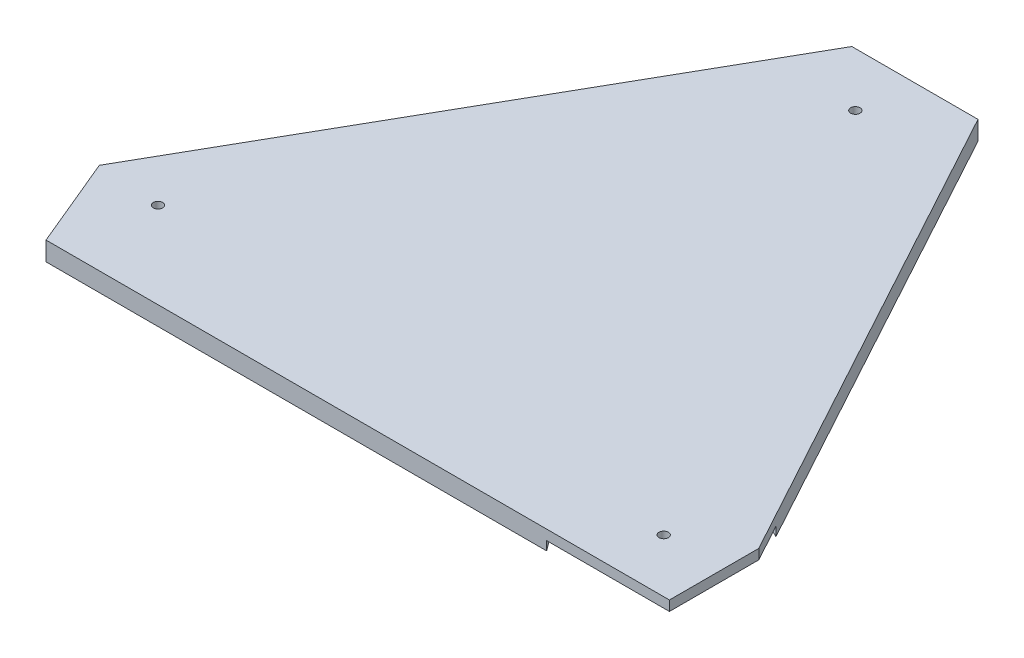
ISO-10303-21;
HEADER;
FILE_DESCRIPTION(('STEP AP214'),'2;1');
FILE_NAME('part.step','',(''),(''),'','','');
FILE_SCHEMA(('AUTOMOTIVE_DESIGN { 1 0 10303 214 1 1 1 1 }'));
ENDSEC;
DATA;
#1=APPLICATION_CONTEXT('core data for automotive mechanical design processes');
#2=APPLICATION_PROTOCOL_DEFINITION('international standard','automotive_design',2000,#1);
#3=PRODUCT_CONTEXT('',#1,'mechanical');
#4=PRODUCT('Part','Part','',(#3));
#5=PRODUCT_RELATED_PRODUCT_CATEGORY('part','',(#4));
#6=PRODUCT_DEFINITION_FORMATION('','',#4);
#7=PRODUCT_DEFINITION_CONTEXT('part definition',#1,'design');
#8=PRODUCT_DEFINITION('design','',#6,#7);
#9=PRODUCT_DEFINITION_SHAPE('','',#8);
#10=(LENGTH_UNIT() NAMED_UNIT(*) SI_UNIT(.MILLI.,.METRE.));
#11=(NAMED_UNIT(*) PLANE_ANGLE_UNIT() SI_UNIT($,.RADIAN.));
#12=(NAMED_UNIT(*) SI_UNIT($,.STERADIAN.) SOLID_ANGLE_UNIT());
#13=UNCERTAINTY_MEASURE_WITH_UNIT(LENGTH_MEASURE(1.E-05),#10,'distance_accuracy_value','');
#14=(GEOMETRIC_REPRESENTATION_CONTEXT(3) GLOBAL_UNCERTAINTY_ASSIGNED_CONTEXT((#13)) GLOBAL_UNIT_ASSIGNED_CONTEXT((#10,
#11,#12)) REPRESENTATION_CONTEXT('',''));
#15=CARTESIAN_POINT('',(0.,0.,0.));
#16=DIRECTION('',(0.,0.,1.));
#17=DIRECTION('',(1.,0.,0.));
#18=AXIS2_PLACEMENT_3D('',#15,#16,#17);
#19=CARTESIAN_POINT('',(0.,15.875,-75.0824));
#20=DIRECTION('',(-1.,0.,0.));
#21=DIRECTION('',(0.,0.,1.));
#22=AXIS2_PLACEMENT_3D('',#19,#20,#21);
#23=PLANE('',#22);
#24=DIRECTION('',(0.,0.,1.));
#25=VECTOR('',#24,1.);
#26=CARTESIAN_POINT('',(0.,7.493,-75.0824));
#27=LINE('',#26,#25);
#28=CARTESIAN_POINT('',(0.,7.493,-75.0824));
#29=VERTEX_POINT('',#28);
#30=CARTESIAN_POINT('',(0.,7.493,0.));
#31=VERTEX_POINT('',#30);
#32=EDGE_CURVE('E216',#29,#31,#27,.T.);
#33=ORIENTED_EDGE('',*,*,#32,.F.);
#34=DIRECTION('',(0.,-1.,0.));
#35=VECTOR('',#34,1.);
#36=CARTESIAN_POINT('',(0.,15.875,-75.0824));
#37=LINE('',#36,#35);
#38=CARTESIAN_POINT('',(0.,15.875,-75.0824));
#39=VERTEX_POINT('',#38);
#40=EDGE_CURVE('E11',#39,#29,#37,.T.);
#41=ORIENTED_EDGE('',*,*,#40,.F.);
#42=DIRECTION('',(0.,0.,-1.));
#43=VECTOR('',#42,1.);
#44=CARTESIAN_POINT('',(0.,15.875,-75.0824));
#45=LINE('',#44,#43);
#46=CARTESIAN_POINT('',(0.,15.875,0.));
#47=VERTEX_POINT('',#46);
#48=EDGE_CURVE('E173',#47,#39,#45,.T.);
#49=ORIENTED_EDGE('',*,*,#48,.F.);
#50=DIRECTION('',(0.,-1.,0.));
#51=VECTOR('',#50,1.);
#52=CARTESIAN_POINT('',(0.,15.875,0.));
#53=LINE('',#52,#51);
#54=EDGE_CURVE('E174',#47,#31,#53,.T.);
#55=ORIENTED_EDGE('',*,*,#54,.T.);
#56=EDGE_LOOP('',(#33,#41,#49,#55));
#57=FACE_BOUND('',#56,.T.);
#58=ADVANCED_FACE('F38',(#57),#23,.F.);
#59=CARTESIAN_POINT('',(-49.7332,0.,-44.9325999999999));
#60=DIRECTION('',(0.,1.,0.));
#61=DIRECTION('',(0.,0.,1.));
#62=AXIS2_PLACEMENT_3D('',#59,#60,#61);
#63=CYLINDRICAL_SURFACE('',#62,3.96874999999998);
#64=CARTESIAN_POINT('',(-49.7332,15.875,-44.9325999999999));
#65=DIRECTION('',(0.,1.,0.));
#66=DIRECTION('',(0.,0.,1.));
#67=AXIS2_PLACEMENT_3D('',#64,#65,#66);
#68=CIRCLE('',#67,3.96874999999998);
#69=CARTESIAN_POINT('',(-49.7332,15.875,-40.96385));
#70=VERTEX_POINT('',#69);
#71=EDGE_CURVE('E237',#70,#70,#68,.T.);
#72=ORIENTED_EDGE('',*,*,#71,.T.);
#73=EDGE_LOOP('',(#72));
#74=FACE_BOUND('',#73,.T.);
#75=CARTESIAN_POINT('',(-49.7332,7.493,-44.9325999999999));
#76=DIRECTION('',(0.,-1.,0.));
#77=DIRECTION('',(0.,0.,-1.));
#78=AXIS2_PLACEMENT_3D('',#75,#76,#77);
#79=CIRCLE('',#78,3.96874999999998);
#80=CARTESIAN_POINT('',(-49.7332,7.493,-48.9013499999999));
#81=VERTEX_POINT('',#80);
#82=EDGE_CURVE('E41',#81,#81,#79,.F.);
#83=ORIENTED_EDGE('',*,*,#82,.F.);
#84=EDGE_LOOP('',(#83));
#85=FACE_BOUND('',#84,.T.);
#86=ADVANCED_FACE('F324',(#74,#85),#63,.F.);
#87=CARTESIAN_POINT('',(-502.204578123616,0.,-72.4407999999999));
#88=DIRECTION('',(0.,1.,0.));
#89=DIRECTION('',(0.,0.,1.));
#90=AXIS2_PLACEMENT_3D('',#87,#88,#89);
#91=CYLINDRICAL_SURFACE('',#90,3.96875000000005);
#92=CARTESIAN_POINT('',(-502.204578123616,15.875,-72.4407999999999));
#93=DIRECTION('',(0.,1.,0.));
#94=DIRECTION('',(0.,0.,1.));
#95=AXIS2_PLACEMENT_3D('',#92,#93,#94);
#96=CIRCLE('',#95,3.96875000000005);
#97=CARTESIAN_POINT('',(-502.204578123616,15.875,-68.4720499999999));
#98=VERTEX_POINT('',#97);
#99=EDGE_CURVE('E241',#98,#98,#96,.T.);
#100=ORIENTED_EDGE('',*,*,#99,.T.);
#101=EDGE_LOOP('',(#100));
#102=FACE_BOUND('',#101,.T.);
#103=CARTESIAN_POINT('',(-502.204578123616,7.493,-72.4407999999999));
#104=DIRECTION('',(0.,-1.,0.));
#105=DIRECTION('',(0.,0.,-1.));
#106=AXIS2_PLACEMENT_3D('',#103,#104,#105);
#107=CIRCLE('',#106,3.96875000000005);
#108=CARTESIAN_POINT('',(-502.204578123616,7.493,-76.40955));
#109=VERTEX_POINT('',#108);
#110=EDGE_CURVE('E197',#109,#109,#107,.F.);
#111=ORIENTED_EDGE('',*,*,#110,.F.);
#112=EDGE_LOOP('',(#111));
#113=FACE_BOUND('',#112,.T.);
#114=ADVANCED_FACE('F329',(#102,#113),#91,.F.);
#115=CARTESIAN_POINT('',(-278.106809958904,0.,-434.34));
#116=DIRECTION('',(0.,1.,0.));
#117=DIRECTION('',(0.,0.,1.));
#118=AXIS2_PLACEMENT_3D('',#115,#116,#117);
#119=CYLINDRICAL_SURFACE('',#118,3.96875000000005);
#120=CARTESIAN_POINT('',(-278.106809958904,15.875,-434.34));
#121=DIRECTION('',(0.,1.,0.));
#122=DIRECTION('',(0.,0.,1.));
#123=AXIS2_PLACEMENT_3D('',#120,#121,#122);
#124=CIRCLE('',#123,3.96875000000005);
#125=CARTESIAN_POINT('',(-278.106809958904,15.875,-430.37125));
#126=VERTEX_POINT('',#125);
#127=EDGE_CURVE('E160',#126,#126,#124,.T.);
#128=ORIENTED_EDGE('',*,*,#127,.T.);
#129=EDGE_LOOP('',(#128));
#130=FACE_BOUND('',#129,.T.);
#131=CARTESIAN_POINT('',(-278.106809958904,7.493,-434.34));
#132=DIRECTION('',(0.,-1.,0.));
#133=DIRECTION('',(0.,0.,-1.));
#134=AXIS2_PLACEMENT_3D('',#131,#132,#133);
#135=CIRCLE('',#134,3.96875000000005);
#136=CARTESIAN_POINT('',(-278.106809958904,7.493,-438.30875));
#137=VERTEX_POINT('',#136);
#138=EDGE_CURVE('E193',#137,#137,#135,.F.);
#139=ORIENTED_EDGE('',*,*,#138,.F.);
#140=EDGE_LOOP('',(#139));
#141=FACE_BOUND('',#140,.T.);
#142=ADVANCED_FACE('F335',(#130,#141),#119,.F.);
#143=CARTESIAN_POINT('',(-220.118609958904,15.875,-479.425));
#144=DIRECTION('',(-0.878289655172414,0.,0.478128938276196));
#145=DIRECTION('',(0.478128938276196,0.,0.878289655172414));
#146=AXIS2_PLACEMENT_3D('',#143,#144,#145);
#147=PLANE('',#146);
#148=DIRECTION('',(0.478128938276196,0.,0.878289655172414));
#149=VECTOR('',#148,1.);
#150=CARTESIAN_POINT('',(-220.118609958904,7.493,-479.425));
#151=LINE('',#150,#149);
#152=CARTESIAN_POINT('',(-17.2504188678722,7.493,-106.770221476915));
#153=VERTEX_POINT('',#152);
#154=EDGE_CURVE('E219',#153,#29,#151,.T.);
#155=ORIENTED_EDGE('',*,*,#154,.F.);
#156=DIRECTION('',(0.,-1.,0.));
#157=VECTOR('',#156,1.);
#158=CARTESIAN_POINT('',(-17.2504188678722,7.493,-106.770221476915));
#159=LINE('',#158,#157);
#160=CARTESIAN_POINT('',(-17.2504188678723,0.,-106.770221476915));
#161=VERTEX_POINT('',#160);
#162=EDGE_CURVE('E227',#153,#161,#159,.T.);
#163=ORIENTED_EDGE('',*,*,#162,.T.);
#164=DIRECTION('',(-0.478128938276196,0.,-0.878289655172414));
#165=VECTOR('',#164,1.);
#166=CARTESIAN_POINT('',(-220.118609958904,0.,-479.425));
#167=LINE('',#166,#165);
#168=CARTESIAN_POINT('',(-220.118609958904,0.,-479.425));
#169=VERTEX_POINT('',#168);
#170=EDGE_CURVE('E156',#161,#169,#167,.T.);
#171=ORIENTED_EDGE('',*,*,#170,.T.);
#172=DIRECTION('',(0.,-1.,0.));
#173=VECTOR('',#172,1.);
#174=CARTESIAN_POINT('',(-220.118609958904,15.875,-479.425));
#175=LINE('',#174,#173);
#176=CARTESIAN_POINT('',(-220.118609958904,15.875,-479.425));
#177=VERTEX_POINT('',#176);
#178=EDGE_CURVE('E47',#177,#169,#175,.T.);
#179=ORIENTED_EDGE('',*,*,#178,.F.);
#180=DIRECTION('',(-0.478128938276196,0.,-0.878289655172414));
#181=VECTOR('',#180,1.);
#182=CARTESIAN_POINT('',(-220.118609958904,15.875,-479.425));
#183=LINE('',#182,#181);
#184=EDGE_CURVE('E251',#39,#177,#183,.T.);
#185=ORIENTED_EDGE('',*,*,#184,.F.);
#186=ORIENTED_EDGE('',*,*,#40,.T.);
#187=EDGE_LOOP('',(#155,#163,#171,#179,#185,#186));
#188=FACE_BOUND('',#187,.T.);
#189=ADVANCED_FACE('F278',(#188),#147,.F.);
#190=CARTESIAN_POINT('',(-326.138209958904,15.875,-479.425));
#191=DIRECTION('',(0.,0.,1.));
#192=DIRECTION('',(1.,0.,0.));
#193=AXIS2_PLACEMENT_3D('',#190,#191,#192);
#194=PLANE('',#193);
#195=DIRECTION('',(1.,0.,0.));
#196=VECTOR('',#195,1.);
#197=CARTESIAN_POINT('',(-326.138209958904,7.493,-479.425));
#198=LINE('',#197,#196);
#199=CARTESIAN_POINT('',(-322.823616363208,7.493,-479.425));
#200=VERTEX_POINT('',#199);
#201=CARTESIAN_POINT('',(-233.3900035546,7.493,-479.425));
#202=VERTEX_POINT('',#201);
#203=EDGE_CURVE('E146',#200,#202,#198,.T.);
#204=ORIENTED_EDGE('',*,*,#203,.F.);
#205=DIRECTION('',(0.,-1.,0.));
#206=VECTOR('',#205,1.);
#207=CARTESIAN_POINT('',(-322.823616363208,7.493,-479.425));
#208=LINE('',#207,#206);
#209=CARTESIAN_POINT('',(-322.823616363208,0.,-479.425));
#210=VERTEX_POINT('',#209);
#211=EDGE_CURVE('E131',#200,#210,#208,.T.);
#212=ORIENTED_EDGE('',*,*,#211,.T.);
#213=DIRECTION('',(-1.,0.,0.));
#214=VECTOR('',#213,1.);
#215=CARTESIAN_POINT('',(-326.138209958904,0.,-479.425));
#216=LINE('',#215,#214);
#217=CARTESIAN_POINT('',(-326.138209958904,0.,-479.425));
#218=VERTEX_POINT('',#217);
#219=EDGE_CURVE('E144',#210,#218,#216,.T.);
#220=ORIENTED_EDGE('',*,*,#219,.T.);
#221=DIRECTION('',(0.,-1.,0.));
#222=VECTOR('',#221,1.);
#223=CARTESIAN_POINT('',(-326.138209958904,15.875,-479.425));
#224=LINE('',#223,#222);
#225=CARTESIAN_POINT('',(-326.138209958904,15.875,-479.425));
#226=VERTEX_POINT('',#225);
#227=EDGE_CURVE('E187',#226,#218,#224,.T.);
#228=ORIENTED_EDGE('',*,*,#227,.F.);
#229=DIRECTION('',(-1.,0.,0.));
#230=VECTOR('',#229,1.);
#231=CARTESIAN_POINT('',(-326.138209958904,15.875,-479.425));
#232=LINE('',#231,#230);
#233=EDGE_CURVE('E254',#177,#226,#232,.T.);
#234=ORIENTED_EDGE('',*,*,#233,.F.);
#235=ORIENTED_EDGE('',*,*,#178,.T.);
#236=CARTESIAN_POINT('',(-233.3900035546,0.,-479.425));
#237=VERTEX_POINT('',#236);
#238=EDGE_CURVE('E155',#169,#237,#216,.T.);
#239=ORIENTED_EDGE('',*,*,#238,.T.);
#240=DIRECTION('',(0.,-1.,0.));
#241=VECTOR('',#240,1.);
#242=CARTESIAN_POINT('',(-233.3900035546,7.493,-479.425));
#243=LINE('',#242,#241);
#244=EDGE_CURVE('E55',#237,#202,#243,.F.);
#245=ORIENTED_EDGE('',*,*,#244,.T.);
#246=EDGE_LOOP('',(#204,#212,#220,#228,#234,#235,#239,#245));
#247=FACE_BOUND('',#246,.T.);
#248=ADVANCED_FACE('F142',(#247),#194,.F.);
#249=CARTESIAN_POINT('',(-555.849378123616,15.875,-76.7944227701986));
#250=DIRECTION('',(0.868580686505882,0.,0.495547768665112));
#251=DIRECTION('',(0.495547768665112,0.,-0.868580686505882));
#252=AXIS2_PLACEMENT_3D('',#249,#250,#251);
#253=PLANE('',#252);
#254=DIRECTION('',(-0.495547768665112,0.,0.868580686505882));
#255=VECTOR('',#254,1.);
#256=CARTESIAN_POINT('',(-555.849378123616,0.,-76.7944227701986));
#257=LINE('',#256,#255);
#258=CARTESIAN_POINT('',(-524.387291001228,0.,-131.940188647191));
#259=VERTEX_POINT('',#258);
#260=EDGE_CURVE('E153',#218,#259,#257,.T.);
#261=ORIENTED_EDGE('',*,*,#260,.T.);
#262=DIRECTION('',(0.,-1.,0.));
#263=VECTOR('',#262,1.);
#264=CARTESIAN_POINT('',(-524.387291001228,7.493,-131.940188647191));
#265=LINE('',#264,#263);
#266=CARTESIAN_POINT('',(-524.387291001228,7.493,-131.940188647191));
#267=VERTEX_POINT('',#266);
#268=EDGE_CURVE('E63',#259,#267,#265,.F.);
#269=ORIENTED_EDGE('',*,*,#268,.T.);
#270=DIRECTION('',(0.495547768665112,0.,-0.868580686505882));
#271=VECTOR('',#270,1.);
#272=CARTESIAN_POINT('',(-555.849378123616,7.493,-76.7944227701986));
#273=LINE('',#272,#271);
#274=CARTESIAN_POINT('',(-555.849378123616,7.493,-76.7944227701986));
#275=VERTEX_POINT('',#274);
#276=EDGE_CURVE('E205',#275,#267,#273,.T.);
#277=ORIENTED_EDGE('',*,*,#276,.F.);
#278=DIRECTION('',(0.,-1.,0.));
#279=VECTOR('',#278,1.);
#280=CARTESIAN_POINT('',(-555.849378123616,15.875,-76.7944227701986));
#281=LINE('',#280,#279);
#282=CARTESIAN_POINT('',(-555.849378123616,15.875,-76.7944227701986));
#283=VERTEX_POINT('',#282);
#284=EDGE_CURVE('E183',#283,#275,#281,.T.);
#285=ORIENTED_EDGE('',*,*,#284,.F.);
#286=DIRECTION('',(-0.495547768665112,0.,0.868580686505882));
#287=VECTOR('',#286,1.);
#288=CARTESIAN_POINT('',(-555.849378123616,15.875,-76.7944227701986));
#289=LINE('',#288,#287);
#290=EDGE_CURVE('E257',#226,#283,#289,.T.);
#291=ORIENTED_EDGE('',*,*,#290,.F.);
#292=ORIENTED_EDGE('',*,*,#227,.T.);
#293=EDGE_LOOP('',(#261,#269,#277,#285,#291,#292));
#294=FACE_BOUND('',#293,.T.);
#295=ADVANCED_FACE('F284',(#294),#253,.F.);
#296=CARTESIAN_POINT('',(-523.875,15.875,0.));
#297=DIRECTION('',(0.92317632710463,0.,-0.384376728059342));
#298=DIRECTION('',(-0.384376728059342,0.,-0.92317632710463));
#299=AXIS2_PLACEMENT_3D('',#296,#297,#298);
#300=PLANE('',#299);
#301=DIRECTION('',(-0.384376728059342,0.,-0.92317632710463));
#302=VECTOR('',#301,1.);
#303=CARTESIAN_POINT('',(-523.875,7.493,0.));
#304=LINE('',#303,#302);
#305=CARTESIAN_POINT('',(-530.333082510439,7.493,-15.5106916129567));
#306=VERTEX_POINT('',#305);
#307=EDGE_CURVE('E200',#306,#275,#304,.T.);
#308=ORIENTED_EDGE('',*,*,#307,.F.);
#309=DIRECTION('',(0.,-1.,0.));
#310=VECTOR('',#309,1.);
#311=CARTESIAN_POINT('',(-530.333082510439,7.493,-15.5106916129566));
#312=LINE('',#311,#310);
#313=CARTESIAN_POINT('',(-530.333082510439,0.,-15.5106916129566));
#314=VERTEX_POINT('',#313);
#315=EDGE_CURVE('E231',#306,#314,#312,.T.);
#316=ORIENTED_EDGE('',*,*,#315,.T.);
#317=DIRECTION('',(0.384376728059342,0.,0.92317632710463));
#318=VECTOR('',#317,1.);
#319=CARTESIAN_POINT('',(-523.875,0.,0.));
#320=LINE('',#319,#318);
#321=CARTESIAN_POINT('',(-523.875,0.,0.));
#322=VERTEX_POINT('',#321);
#323=EDGE_CURVE('E166',#314,#322,#320,.T.);
#324=ORIENTED_EDGE('',*,*,#323,.T.);
#325=DIRECTION('',(0.,-1.,0.));
#326=VECTOR('',#325,1.);
#327=CARTESIAN_POINT('',(-523.875,15.875,0.));
#328=LINE('',#327,#326);
#329=CARTESIAN_POINT('',(-523.875,15.875,0.));
#330=VERTEX_POINT('',#329);
#331=EDGE_CURVE('E178',#330,#322,#328,.T.);
#332=ORIENTED_EDGE('',*,*,#331,.F.);
#333=DIRECTION('',(0.384376728059342,0.,0.92317632710463));
#334=VECTOR('',#333,1.);
#335=CARTESIAN_POINT('',(-523.875,15.875,0.));
#336=LINE('',#335,#334);
#337=EDGE_CURVE('E260',#283,#330,#336,.T.);
#338=ORIENTED_EDGE('',*,*,#337,.F.);
#339=ORIENTED_EDGE('',*,*,#284,.T.);
#340=EDGE_LOOP('',(#308,#316,#324,#332,#338,#339));
#341=FACE_BOUND('',#340,.T.);
#342=ADVANCED_FACE('F288',(#341),#300,.F.);
#343=CARTESIAN_POINT('',(0.,15.875,0.));
#344=DIRECTION('',(0.,0.,-1.));
#345=DIRECTION('',(-1.,0.,0.));
#346=AXIS2_PLACEMENT_3D('',#343,#344,#345);
#347=PLANE('',#346);
#348=DIRECTION('',(1.,0.,0.));
#349=VECTOR('',#348,1.);
#350=CARTESIAN_POINT('',(0.,0.,0.));
#351=LINE('',#350,#349);
#352=CARTESIAN_POINT('',(-103.212952778411,0.,0.));
#353=VERTEX_POINT('',#352);
#354=EDGE_CURVE('E169',#322,#353,#351,.T.);
#355=ORIENTED_EDGE('',*,*,#354,.T.);
#356=DIRECTION('',(0.,-1.,0.));
#357=VECTOR('',#356,1.);
#358=CARTESIAN_POINT('',(-103.212952778411,7.493,0.));
#359=LINE('',#358,#357);
#360=CARTESIAN_POINT('',(-103.212952778411,7.493,0.));
#361=VERTEX_POINT('',#360);
#362=EDGE_CURVE('E148',#353,#361,#359,.F.);
#363=ORIENTED_EDGE('',*,*,#362,.T.);
#364=DIRECTION('',(-1.,0.,0.));
#365=VECTOR('',#364,1.);
#366=CARTESIAN_POINT('',(0.,7.493,0.));
#367=LINE('',#366,#365);
#368=EDGE_CURVE('E213',#31,#361,#367,.T.);
#369=ORIENTED_EDGE('',*,*,#368,.F.);
#370=ORIENTED_EDGE('',*,*,#54,.F.);
#371=DIRECTION('',(1.,0.,0.));
#372=VECTOR('',#371,1.);
#373=CARTESIAN_POINT('',(0.,15.875,0.));
#374=LINE('',#373,#372);
#375=EDGE_CURVE('E179',#330,#47,#374,.T.);
#376=ORIENTED_EDGE('',*,*,#375,.F.);
#377=ORIENTED_EDGE('',*,*,#331,.T.);
#378=EDGE_LOOP('',(#355,#363,#369,#370,#376,#377));
#379=FACE_BOUND('',#378,.T.);
#380=ADVANCED_FACE('F273',(#379),#347,.F.);
#381=CARTESIAN_POINT('',(0.,15.875,0.));
#382=DIRECTION('',(0.,-1.,0.));
#383=DIRECTION('',(0.,0.,-1.));
#384=AXIS2_PLACEMENT_3D('',#381,#382,#383);
#385=PLANE('',#384);
#386=ORIENTED_EDGE('',*,*,#127,.F.);
#387=EDGE_LOOP('',(#386));
#388=FACE_BOUND('',#387,.T.);
#389=ORIENTED_EDGE('',*,*,#99,.F.);
#390=EDGE_LOOP('',(#389));
#391=FACE_BOUND('',#390,.T.);
#392=ORIENTED_EDGE('',*,*,#71,.F.);
#393=EDGE_LOOP('',(#392));
#394=FACE_BOUND('',#393,.T.);
#395=ORIENTED_EDGE('',*,*,#48,.T.);
#396=ORIENTED_EDGE('',*,*,#184,.T.);
#397=ORIENTED_EDGE('',*,*,#233,.T.);
#398=ORIENTED_EDGE('',*,*,#290,.T.);
#399=ORIENTED_EDGE('',*,*,#337,.T.);
#400=ORIENTED_EDGE('',*,*,#375,.T.);
#401=EDGE_LOOP('',(#395,#396,#397,#398,#399,#400));
#402=FACE_BOUND('',#401,.T.);
#403=ADVANCED_FACE('F266',(#388,#391,#394,#402),#385,.F.);
#404=CARTESIAN_POINT('',(0.,0.,0.));
#405=DIRECTION('',(0.,-1.,0.));
#406=DIRECTION('',(0.,0.,-1.));
#407=AXIS2_PLACEMENT_3D('',#404,#405,#406);
#408=PLANE('',#407);
#409=CARTESIAN_POINT('',(-502.204578123616,0.,-72.4407999999999));
#410=DIRECTION('',(0.,-1.,0.));
#411=DIRECTION('',(0.,0.,-1.));
#412=AXIS2_PLACEMENT_3D('',#409,#410,#411);
#413=CIRCLE('',#412,63.5);
#414=EDGE_CURVE('E301',#259,#314,#413,.T.);
#415=ORIENTED_EDGE('',*,*,#414,.F.);
#416=ORIENTED_EDGE('',*,*,#260,.F.);
#417=ORIENTED_EDGE('',*,*,#219,.F.);
#418=CARTESIAN_POINT('',(-278.106809958904,0.,-434.34));
#419=DIRECTION('',(0.,-1.,0.));
#420=DIRECTION('',(0.,0.,-1.));
#421=AXIS2_PLACEMENT_3D('',#418,#419,#420);
#422=CIRCLE('',#421,63.5);
#423=EDGE_CURVE('E128',#237,#210,#422,.T.);
#424=ORIENTED_EDGE('',*,*,#423,.F.);
#425=ORIENTED_EDGE('',*,*,#238,.F.);
#426=ORIENTED_EDGE('',*,*,#170,.F.);
#427=CARTESIAN_POINT('',(-49.7332,0.,-44.9325999999999));
#428=DIRECTION('',(0.,-1.,0.));
#429=DIRECTION('',(0.,0.,-1.));
#430=AXIS2_PLACEMENT_3D('',#427,#428,#429);
#431=CIRCLE('',#430,69.85);
#432=EDGE_CURVE('E293',#353,#161,#431,.T.);
#433=ORIENTED_EDGE('',*,*,#432,.F.);
#434=ORIENTED_EDGE('',*,*,#354,.F.);
#435=ORIENTED_EDGE('',*,*,#323,.F.);
#436=EDGE_LOOP('',(#415,#416,#417,#424,#425,#426,#433,#434,#435));
#437=FACE_BOUND('',#436,.T.);
#438=ADVANCED_FACE('F151',(#437),#408,.T.);
#439=CARTESIAN_POINT('',(-278.106809958904,7.493,-434.34));
#440=DIRECTION('',(0.,-1.,0.));
#441=DIRECTION('',(0.,0.,-1.));
#442=AXIS2_PLACEMENT_3D('',#439,#440,#441);
#443=CYLINDRICAL_SURFACE('',#442,63.5);
#444=CARTESIAN_POINT('',(-278.106809958904,7.493,-434.34));
#445=DIRECTION('',(0.,-1.,0.));
#446=DIRECTION('',(0.,0.,-1.));
#447=AXIS2_PLACEMENT_3D('',#444,#445,#446);
#448=CIRCLE('',#447,63.5);
#449=EDGE_CURVE('E138',#202,#200,#448,.T.);
#450=ORIENTED_EDGE('',*,*,#449,.F.);
#451=ORIENTED_EDGE('',*,*,#244,.F.);
#452=ORIENTED_EDGE('',*,*,#423,.T.);
#453=ORIENTED_EDGE('',*,*,#211,.F.);
#454=EDGE_LOOP('',(#450,#451,#452,#453));
#455=FACE_BOUND('',#454,.T.);
#456=ADVANCED_FACE('F130',(#455),#443,.F.);
#457=CARTESIAN_POINT('',(-278.106809958904,7.493,-434.34));
#458=DIRECTION('',(0.,-1.,0.));
#459=DIRECTION('',(0.,0.,-1.));
#460=AXIS2_PLACEMENT_3D('',#457,#458,#459);
#461=PLANE('',#460);
#462=ORIENTED_EDGE('',*,*,#138,.T.);
#463=EDGE_LOOP('',(#462));
#464=FACE_BOUND('',#463,.T.);
#465=ORIENTED_EDGE('',*,*,#203,.T.);
#466=ORIENTED_EDGE('',*,*,#449,.T.);
#467=EDGE_LOOP('',(#465,#466));
#468=FACE_BOUND('',#467,.T.);
#469=ADVANCED_FACE('F312',(#464,#468),#461,.T.);
#470=CARTESIAN_POINT('',(-502.204578123616,7.493,-72.4407999999999));
#471=DIRECTION('',(0.,-1.,0.));
#472=DIRECTION('',(0.,0.,-1.));
#473=AXIS2_PLACEMENT_3D('',#470,#471,#472);
#474=CYLINDRICAL_SURFACE('',#473,63.5);
#475=ORIENTED_EDGE('',*,*,#414,.T.);
#476=ORIENTED_EDGE('',*,*,#315,.F.);
#477=CARTESIAN_POINT('',(-502.204578123616,7.493,-72.4407999999999));
#478=DIRECTION('',(0.,-1.,0.));
#479=DIRECTION('',(0.,0.,-1.));
#480=AXIS2_PLACEMENT_3D('',#477,#478,#479);
#481=CIRCLE('',#480,63.5);
#482=EDGE_CURVE('E196',#267,#306,#481,.T.);
#483=ORIENTED_EDGE('',*,*,#482,.F.);
#484=ORIENTED_EDGE('',*,*,#268,.F.);
#485=EDGE_LOOP('',(#475,#476,#483,#484));
#486=FACE_BOUND('',#485,.T.);
#487=ADVANCED_FACE('F310',(#486),#474,.F.);
#488=CARTESIAN_POINT('',(-502.204578123616,7.493,-72.4407999999999));
#489=DIRECTION('',(0.,-1.,0.));
#490=DIRECTION('',(0.,0.,-1.));
#491=AXIS2_PLACEMENT_3D('',#488,#489,#490);
#492=PLANE('',#491);
#493=ORIENTED_EDGE('',*,*,#110,.T.);
#494=EDGE_LOOP('',(#493));
#495=FACE_BOUND('',#494,.T.);
#496=ORIENTED_EDGE('',*,*,#276,.T.);
#497=ORIENTED_EDGE('',*,*,#482,.T.);
#498=ORIENTED_EDGE('',*,*,#307,.T.);
#499=EDGE_LOOP('',(#496,#497,#498));
#500=FACE_BOUND('',#499,.T.);
#501=ADVANCED_FACE('F309',(#495,#500),#492,.T.);
#502=CARTESIAN_POINT('',(-49.7332,7.493,-44.9325999999999));
#503=DIRECTION('',(0.,-1.,0.));
#504=DIRECTION('',(0.,0.,-1.));
#505=AXIS2_PLACEMENT_3D('',#502,#503,#504);
#506=CYLINDRICAL_SURFACE('',#505,69.85);
#507=CARTESIAN_POINT('',(-49.7332,7.493,-44.9325999999999));
#508=DIRECTION('',(0.,-1.,0.));
#509=DIRECTION('',(0.,0.,-1.));
#510=AXIS2_PLACEMENT_3D('',#507,#508,#509);
#511=CIRCLE('',#510,69.85);
#512=EDGE_CURVE('E296',#361,#153,#511,.T.);
#513=ORIENTED_EDGE('',*,*,#512,.F.);
#514=ORIENTED_EDGE('',*,*,#362,.F.);
#515=ORIENTED_EDGE('',*,*,#432,.T.);
#516=ORIENTED_EDGE('',*,*,#162,.F.);
#517=EDGE_LOOP('',(#513,#514,#515,#516));
#518=FACE_BOUND('',#517,.T.);
#519=ADVANCED_FACE('F318',(#518),#506,.F.);
#520=CARTESIAN_POINT('',(-49.7332,7.493,-44.9325999999999));
#521=DIRECTION('',(0.,-1.,0.));
#522=DIRECTION('',(0.,0.,-1.));
#523=AXIS2_PLACEMENT_3D('',#520,#521,#522);
#524=PLANE('',#523);
#525=ORIENTED_EDGE('',*,*,#82,.T.);
#526=EDGE_LOOP('',(#525));
#527=FACE_BOUND('',#526,.T.);
#528=ORIENTED_EDGE('',*,*,#154,.T.);
#529=ORIENTED_EDGE('',*,*,#32,.T.);
#530=ORIENTED_EDGE('',*,*,#368,.T.);
#531=ORIENTED_EDGE('',*,*,#512,.T.);
#532=EDGE_LOOP('',(#528,#529,#530,#531));
#533=FACE_BOUND('',#532,.T.);
#534=ADVANCED_FACE('F364',(#527,#533),#524,.T.);
#535=CLOSED_SHELL('',(#58,#86,#114,#142,#189,#248,#295,#342,#380,#403,#438,#456,#469,#487,#501,
#519,#534));
#536=MANIFOLD_SOLID_BREP('B2',#535);
#537=ADVANCED_BREP_SHAPE_REPRESENTATION('',(#18,#536),#14);
#538=SHAPE_DEFINITION_REPRESENTATION(#9,#537);
ENDSEC;
END-ISO-10303-21;
